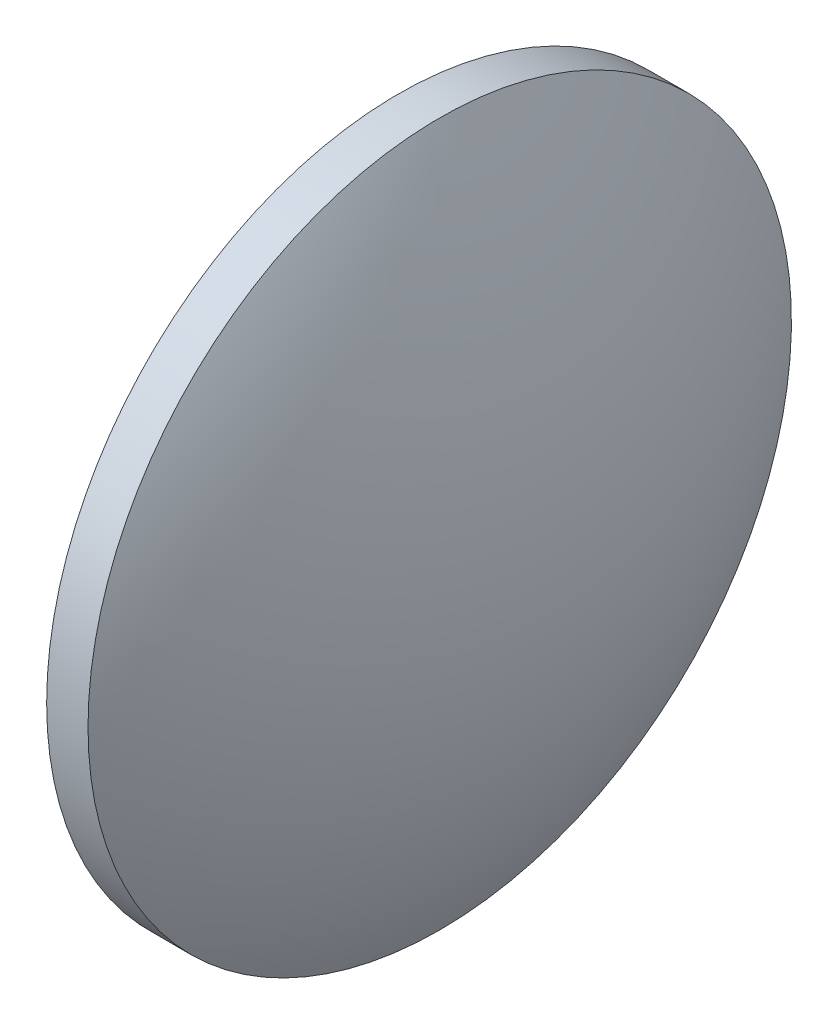
ISO-10303-21;
HEADER;
FILE_DESCRIPTION(('STEP AP214'),'2;1');
FILE_NAME('part.step','',(''),(''),'','','');
FILE_SCHEMA(('AUTOMOTIVE_DESIGN { 1 0 10303 214 1 1 1 1 }'));
ENDSEC;
DATA;
#1=APPLICATION_CONTEXT('core data for automotive mechanical design processes');
#2=APPLICATION_PROTOCOL_DEFINITION('international standard','automotive_design',2000,#1);
#3=PRODUCT_CONTEXT('',#1,'mechanical');
#4=PRODUCT('Part','Part','',(#3));
#5=PRODUCT_RELATED_PRODUCT_CATEGORY('part','',(#4));
#6=PRODUCT_DEFINITION_FORMATION('','',#4);
#7=PRODUCT_DEFINITION_CONTEXT('part definition',#1,'design');
#8=PRODUCT_DEFINITION('design','',#6,#7);
#9=PRODUCT_DEFINITION_SHAPE('','',#8);
#10=(LENGTH_UNIT() NAMED_UNIT(*) SI_UNIT(.MILLI.,.METRE.));
#11=(NAMED_UNIT(*) PLANE_ANGLE_UNIT() SI_UNIT($,.RADIAN.));
#12=(NAMED_UNIT(*) SI_UNIT($,.STERADIAN.) SOLID_ANGLE_UNIT());
#13=UNCERTAINTY_MEASURE_WITH_UNIT(LENGTH_MEASURE(1.E-05),#10,'distance_accuracy_value','');
#14=(GEOMETRIC_REPRESENTATION_CONTEXT(3) GLOBAL_UNCERTAINTY_ASSIGNED_CONTEXT((#13)) GLOBAL_UNIT_ASSIGNED_CONTEXT((#10,
#11,#12)) REPRESENTATION_CONTEXT('',''));
#15=CARTESIAN_POINT('',(0.,0.,0.));
#16=DIRECTION('',(0.,0.,1.));
#17=DIRECTION('',(1.,0.,0.));
#18=AXIS2_PLACEMENT_3D('',#15,#16,#17);
#19=CARTESIAN_POINT('',(533.763471039934,36.8937090806316,0.));
#20=DIRECTION('',(-1.,0.,0.));
#21=DIRECTION('',(0.,-1.,0.));
#22=AXIS2_PLACEMENT_3D('',#19,#20,#21);
#23=SPHERICAL_SURFACE('',#22,25.8023065015479);
#24=CARTESIAN_POINT('',(556.335777541482,36.8937090806315,0.));
#25=DIRECTION('',(-1.,0.,0.));
#26=DIRECTION('',(0.,0.,1.));
#27=AXIS2_PLACEMENT_3D('',#24,#25,#26);
#28=CIRCLE('',#27,12.5);
#29=CARTESIAN_POINT('',(556.335777541482,36.8937090806315,12.5));
#30=VERTEX_POINT('',#29);
#31=EDGE_CURVE('E10',#30,#30,#28,.T.);
#32=ORIENTED_EDGE('',*,*,#31,.F.);
#33=EDGE_LOOP('',(#32));
#34=FACE_BOUND('',#33,.T.);
#35=ADVANCED_FACE('F35',(#34),#23,.T.);
#36=CARTESIAN_POINT('',(552.500161638721,36.8937090806315,0.));
#37=DIRECTION('',(-1.,0.,0.));
#38=DIRECTION('',(0.,0.,1.));
#39=AXIS2_PLACEMENT_3D('',#36,#37,#38);
#40=CYLINDRICAL_SURFACE('',#39,12.5);
#41=CARTESIAN_POINT('',(554.865777541482,36.8937090806315,0.));
#42=DIRECTION('',(-1.,0.,0.));
#43=DIRECTION('',(0.,0.,1.));
#44=AXIS2_PLACEMENT_3D('',#41,#42,#43);
#45=CIRCLE('',#44,12.5);
#46=CARTESIAN_POINT('',(554.865777541482,36.8937090806315,12.5));
#47=VERTEX_POINT('',#46);
#48=EDGE_CURVE('E41',#47,#47,#45,.T.);
#49=ORIENTED_EDGE('',*,*,#48,.F.);
#50=EDGE_LOOP('',(#49));
#51=FACE_BOUND('',#50,.T.);
#52=ORIENTED_EDGE('',*,*,#31,.T.);
#53=EDGE_LOOP('',(#52));
#54=FACE_BOUND('',#53,.T.);
#55=ADVANCED_FACE('F49',(#51,#54),#40,.T.);
#56=CARTESIAN_POINT('',(554.865777541482,36.8937090806315,0.));
#57=DIRECTION('',(1.,0.,0.));
#58=DIRECTION('',(0.,0.,-1.));
#59=AXIS2_PLACEMENT_3D('',#56,#57,#58);
#60=PLANE('',#59);
#61=ORIENTED_EDGE('',*,*,#48,.T.);
#62=EDGE_LOOP('',(#61));
#63=FACE_BOUND('',#62,.T.);
#64=ADVANCED_FACE('F47',(#63),#60,.F.);
#65=CLOSED_SHELL('',(#35,#55,#64));
#66=MANIFOLD_SOLID_BREP('B2',#65);
#67=ADVANCED_BREP_SHAPE_REPRESENTATION('',(#18,#66),#14);
#68=SHAPE_DEFINITION_REPRESENTATION(#9,#67);
ENDSEC;
END-ISO-10303-21;
